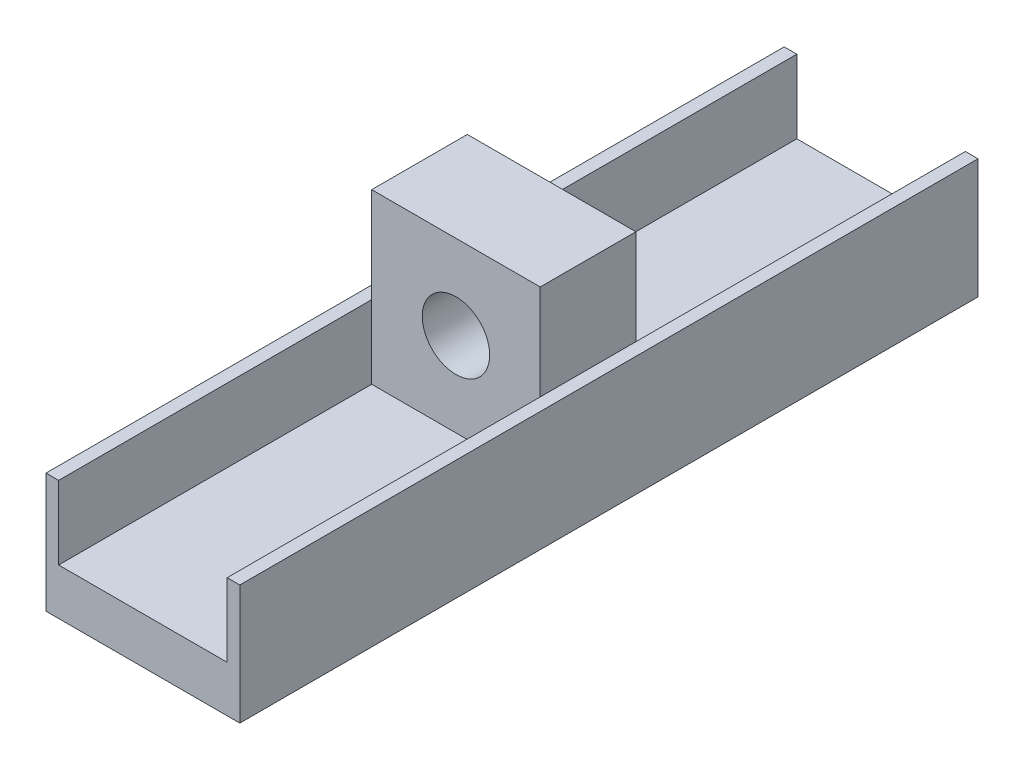
ISO-10303-21;
HEADER;
FILE_DESCRIPTION(('STEP AP214'),'2;1');
FILE_NAME('part.step','',(''),(''),'','','');
FILE_SCHEMA(('AUTOMOTIVE_DESIGN { 1 0 10303 214 1 1 1 1 }'));
ENDSEC;
DATA;
#1=APPLICATION_CONTEXT('core data for automotive mechanical design processes');
#2=APPLICATION_PROTOCOL_DEFINITION('international standard','automotive_design',2000,#1);
#3=PRODUCT_CONTEXT('',#1,'mechanical');
#4=PRODUCT('Part','Part','',(#3));
#5=PRODUCT_RELATED_PRODUCT_CATEGORY('part','',(#4));
#6=PRODUCT_DEFINITION_FORMATION('','',#4);
#7=PRODUCT_DEFINITION_CONTEXT('part definition',#1,'design');
#8=PRODUCT_DEFINITION('design','',#6,#7);
#9=PRODUCT_DEFINITION_SHAPE('','',#8);
#10=(LENGTH_UNIT() NAMED_UNIT(*) SI_UNIT(.MILLI.,.METRE.));
#11=(NAMED_UNIT(*) PLANE_ANGLE_UNIT() SI_UNIT($,.RADIAN.));
#12=(NAMED_UNIT(*) SI_UNIT($,.STERADIAN.) SOLID_ANGLE_UNIT());
#13=UNCERTAINTY_MEASURE_WITH_UNIT(LENGTH_MEASURE(1.E-05),#10,'distance_accuracy_value','');
#14=(GEOMETRIC_REPRESENTATION_CONTEXT(3) GLOBAL_UNCERTAINTY_ASSIGNED_CONTEXT((#13)) GLOBAL_UNIT_ASSIGNED_CONTEXT((#10,
#11,#12)) REPRESENTATION_CONTEXT('',''));
#15=CARTESIAN_POINT('',(0.,0.,0.));
#16=DIRECTION('',(0.,0.,1.));
#17=DIRECTION('',(1.,0.,0.));
#18=AXIS2_PLACEMENT_3D('',#15,#16,#17);
#19=CARTESIAN_POINT('',(1.1,2.60289581411237,13.4));
#20=DIRECTION('',(0.,0.,1.));
#21=DIRECTION('',(1.,0.,0.));
#22=AXIS2_PLACEMENT_3D('',#19,#20,#21);
#23=CYLINDRICAL_SURFACE('',#22,8.);
#24=CARTESIAN_POINT('',(1.1,2.60289581411237,11.1));
#25=DIRECTION('',(0.,0.,1.));
#26=DIRECTION('',(1.,0.,0.));
#27=AXIS2_PLACEMENT_3D('',#24,#25,#26);
#28=CIRCLE('',#27,8.);
#29=CARTESIAN_POINT('',(9.1,2.60289581411237,11.1));
#30=VERTEX_POINT('',#29);
#31=EDGE_CURVE('E162',#30,#30,#28,.F.);
#32=ORIENTED_EDGE('',*,*,#31,.F.);
#33=EDGE_LOOP('',(#32));
#34=FACE_BOUND('',#33,.T.);
#35=CARTESIAN_POINT('',(1.1,2.60289581411237,-11.6));
#36=DIRECTION('',(0.,0.,1.));
#37=DIRECTION('',(1.,0.,0.));
#38=AXIS2_PLACEMENT_3D('',#35,#36,#37);
#39=CIRCLE('',#38,8.);
#40=CARTESIAN_POINT('',(9.1,2.60289581411237,-11.6));
#41=VERTEX_POINT('',#40);
#42=EDGE_CURVE('E20',#41,#41,#39,.F.);
#43=ORIENTED_EDGE('',*,*,#42,.T.);
#44=EDGE_LOOP('',(#43));
#45=FACE_BOUND('',#44,.T.);
#46=ADVANCED_FACE('F17',(#34,#45),#23,.F.);
#47=CARTESIAN_POINT('',(-18.9,22.6028958141124,13.4));
#48=DIRECTION('',(0.,-1.,0.));
#49=DIRECTION('',(0.,0.,-1.));
#50=AXIS2_PLACEMENT_3D('',#47,#48,#49);
#51=PLANE('',#50);
#52=DIRECTION('',(1.,0.,0.));
#53=VECTOR('',#52,1.);
#54=CARTESIAN_POINT('',(-12.1850327602071,22.6028958141124,-11.6));
#55=LINE('',#54,#53);
#56=CARTESIAN_POINT('',(21.1,22.6028958141124,-11.6));
#57=VERTEX_POINT('',#56);
#58=CARTESIAN_POINT('',(-18.9,22.6028958141124,-11.6));
#59=VERTEX_POINT('',#58);
#60=EDGE_CURVE('E142',#57,#59,#55,.F.);
#61=ORIENTED_EDGE('',*,*,#60,.T.);
#62=DIRECTION('',(0.,0.,-1.));
#63=VECTOR('',#62,1.);
#64=CARTESIAN_POINT('',(-18.9,22.6028958141124,13.4));
#65=LINE('',#64,#63);
#66=CARTESIAN_POINT('',(-18.9,22.6028958141124,11.1));
#67=VERTEX_POINT('',#66);
#68=EDGE_CURVE('E145',#59,#67,#65,.F.);
#69=ORIENTED_EDGE('',*,*,#68,.T.);
#70=DIRECTION('',(1.,0.,0.));
#71=VECTOR('',#70,1.);
#72=CARTESIAN_POINT('',(-12.1850327602071,22.6028958141124,11.1));
#73=LINE('',#72,#71);
#74=CARTESIAN_POINT('',(21.1,22.6028958141124,11.1));
#75=VERTEX_POINT('',#74);
#76=EDGE_CURVE('E137',#75,#67,#73,.F.);
#77=ORIENTED_EDGE('',*,*,#76,.F.);
#78=DIRECTION('',(0.,0.,1.));
#79=VECTOR('',#78,1.);
#80=CARTESIAN_POINT('',(21.1,22.6028958141124,13.4));
#81=LINE('',#80,#79);
#82=EDGE_CURVE('E148',#75,#57,#81,.F.);
#83=ORIENTED_EDGE('',*,*,#82,.T.);
#84=EDGE_LOOP('',(#61,#69,#77,#83));
#85=FACE_BOUND('',#84,.T.);
#86=ADVANCED_FACE('F144',(#85),#51,.F.);
#87=CARTESIAN_POINT('',(-12.1850327602071,-25.6006360607454,-11.6));
#88=DIRECTION('',(0.,0.,1.));
#89=DIRECTION('',(1.,0.,0.));
#90=AXIS2_PLACEMENT_3D('',#87,#88,#89);
#91=PLANE('',#90);
#92=DIRECTION('',(1.,0.,0.));
#93=VECTOR('',#92,1.);
#94=CARTESIAN_POINT('',(21.1,-17.3971041858876,-11.6));
#95=LINE('',#94,#93);
#96=CARTESIAN_POINT('',(21.1,-17.3971041858876,-11.6));
#97=VERTEX_POINT('',#96);
#98=CARTESIAN_POINT('',(-18.9,-17.3971041858876,-11.6));
#99=VERTEX_POINT('',#98);
#100=EDGE_CURVE('E198',#97,#99,#95,.F.);
#101=ORIENTED_EDGE('',*,*,#100,.T.);
#102=DIRECTION('',(0.,1.,0.));
#103=VECTOR('',#102,1.);
#104=CARTESIAN_POINT('',(-18.9,-17.3971041858876,-11.6));
#105=LINE('',#104,#103);
#106=CARTESIAN_POINT('',(-18.9,0.,-11.6));
#107=VERTEX_POINT('',#106);
#108=EDGE_CURVE('E167',#99,#107,#105,.T.);
#109=ORIENTED_EDGE('',*,*,#108,.T.);
#110=DIRECTION('',(0.,1.,0.));
#111=VECTOR('',#110,1.);
#112=CARTESIAN_POINT('',(-18.9,-17.3971041858876,-11.6));
#113=LINE('',#112,#111);
#114=EDGE_CURVE('E154',#107,#59,#113,.T.);
#115=ORIENTED_EDGE('',*,*,#114,.T.);
#116=ORIENTED_EDGE('',*,*,#60,.F.);
#117=DIRECTION('',(0.,1.,0.));
#118=VECTOR('',#117,1.);
#119=CARTESIAN_POINT('',(21.1,22.6028958141124,-11.6));
#120=LINE('',#119,#118);
#121=CARTESIAN_POINT('',(21.1,0.,-11.6));
#122=VERTEX_POINT('',#121);
#123=EDGE_CURVE('E190',#57,#122,#120,.F.);
#124=ORIENTED_EDGE('',*,*,#123,.T.);
#125=DIRECTION('',(0.,1.,0.));
#126=VECTOR('',#125,1.);
#127=CARTESIAN_POINT('',(21.1,0.,-11.6));
#128=LINE('',#127,#126);
#129=EDGE_CURVE('E201',#122,#97,#128,.F.);
#130=ORIENTED_EDGE('',*,*,#129,.T.);
#131=EDGE_LOOP('',(#101,#109,#115,#116,#124,#130));
#132=FACE_BOUND('',#131,.T.);
#133=ORIENTED_EDGE('',*,*,#42,.F.);
#134=EDGE_LOOP('',(#133));
#135=FACE_BOUND('',#134,.T.);
#136=ADVANCED_FACE('F165',(#132,#135),#91,.F.);
#137=CARTESIAN_POINT('',(-18.9,-17.3971041858876,13.4));
#138=DIRECTION('',(1.,0.,0.));
#139=DIRECTION('',(0.,0.,-1.));
#140=AXIS2_PLACEMENT_3D('',#137,#138,#139);
#141=PLANE('',#140);
#142=DIRECTION('',(0.,1.,0.));
#143=VECTOR('',#142,1.);
#144=CARTESIAN_POINT('',(-18.9,-25.6006360607454,11.1));
#145=LINE('',#144,#143);
#146=CARTESIAN_POINT('',(-18.9,0.,11.1));
#147=VERTEX_POINT('',#146);
#148=EDGE_CURVE('E160',#67,#147,#145,.F.);
#149=ORIENTED_EDGE('',*,*,#148,.F.);
#150=ORIENTED_EDGE('',*,*,#68,.F.);
#151=ORIENTED_EDGE('',*,*,#114,.F.);
#152=DIRECTION('',(0.,0.,-1.));
#153=VECTOR('',#152,1.);
#154=CARTESIAN_POINT('',(-18.9,0.,-40.));
#155=LINE('',#154,#153);
#156=EDGE_CURVE('E212',#107,#147,#155,.F.);
#157=ORIENTED_EDGE('',*,*,#156,.T.);
#158=EDGE_LOOP('',(#149,#150,#151,#157));
#159=FACE_BOUND('',#158,.T.);
#160=ADVANCED_FACE('F157',(#159),#141,.F.);
#161=CARTESIAN_POINT('',(-12.1850327602071,-25.6006360607454,11.1));
#162=DIRECTION('',(0.,0.,1.));
#163=DIRECTION('',(1.,0.,0.));
#164=AXIS2_PLACEMENT_3D('',#161,#162,#163);
#165=PLANE('',#164);
#166=DIRECTION('',(1.,0.,0.));
#167=VECTOR('',#166,1.);
#168=CARTESIAN_POINT('',(21.1,-17.3971041858876,11.1));
#169=LINE('',#168,#167);
#170=CARTESIAN_POINT('',(-18.9,-17.3971041858876,11.1));
#171=VERTEX_POINT('',#170);
#172=CARTESIAN_POINT('',(21.1,-17.3971041858876,11.1));
#173=VERTEX_POINT('',#172);
#174=EDGE_CURVE('E222',#171,#173,#169,.T.);
#175=ORIENTED_EDGE('',*,*,#174,.T.);
#176=DIRECTION('',(0.,1.,0.));
#177=VECTOR('',#176,1.);
#178=CARTESIAN_POINT('',(21.1,0.,11.1));
#179=LINE('',#178,#177);
#180=CARTESIAN_POINT('',(21.1,0.,11.1));
#181=VERTEX_POINT('',#180);
#182=EDGE_CURVE('E232',#173,#181,#179,.T.);
#183=ORIENTED_EDGE('',*,*,#182,.T.);
#184=DIRECTION('',(0.,1.,0.));
#185=VECTOR('',#184,1.);
#186=CARTESIAN_POINT('',(21.1,22.6028958141124,11.1));
#187=LINE('',#186,#185);
#188=EDGE_CURVE('E183',#181,#75,#187,.T.);
#189=ORIENTED_EDGE('',*,*,#188,.T.);
#190=ORIENTED_EDGE('',*,*,#76,.T.);
#191=ORIENTED_EDGE('',*,*,#148,.T.);
#192=DIRECTION('',(0.,1.,0.));
#193=VECTOR('',#192,1.);
#194=CARTESIAN_POINT('',(-18.9,-17.3971041858876,11.1));
#195=LINE('',#194,#193);
#196=EDGE_CURVE('E214',#147,#171,#195,.F.);
#197=ORIENTED_EDGE('',*,*,#196,.T.);
#198=EDGE_LOOP('',(#175,#183,#189,#190,#191,#197));
#199=FACE_BOUND('',#198,.T.);
#200=ORIENTED_EDGE('',*,*,#31,.T.);
#201=EDGE_LOOP('',(#200));
#202=FACE_BOUND('',#201,.T.);
#203=ADVANCED_FACE('F380',(#199,#202),#165,.T.);
#204=CARTESIAN_POINT('',(21.1,22.6028958141124,13.4));
#205=DIRECTION('',(-1.,0.,0.));
#206=DIRECTION('',(0.,0.,1.));
#207=AXIS2_PLACEMENT_3D('',#204,#205,#206);
#208=PLANE('',#207);
#209=ORIENTED_EDGE('',*,*,#123,.F.);
#210=ORIENTED_EDGE('',*,*,#82,.F.);
#211=ORIENTED_EDGE('',*,*,#188,.F.);
#212=DIRECTION('',(0.,0.,-1.));
#213=VECTOR('',#212,1.);
#214=CARTESIAN_POINT('',(21.1,0.,-40.));
#215=LINE('',#214,#213);
#216=EDGE_CURVE('E240',#181,#122,#215,.T.);
#217=ORIENTED_EDGE('',*,*,#216,.T.);
#218=EDGE_LOOP('',(#209,#210,#211,#217));
#219=FACE_BOUND('',#218,.T.);
#220=ADVANCED_FACE('F376',(#219),#208,.F.);
#221=CARTESIAN_POINT('',(-18.9,-17.3971041858876,-40.));
#222=DIRECTION('',(-1.,0.,0.));
#223=DIRECTION('',(0.,0.,1.));
#224=AXIS2_PLACEMENT_3D('',#221,#222,#223);
#225=PLANE('',#224);
#226=ORIENTED_EDGE('',*,*,#108,.F.);
#227=DIRECTION('',(0.,0.,-1.));
#228=VECTOR('',#227,1.);
#229=CARTESIAN_POINT('',(-18.9,-17.3971041858876,-40.));
#230=LINE('',#229,#228);
#231=CARTESIAN_POINT('',(-18.9,-17.3971041858876,-89.8));
#232=VERTEX_POINT('',#231);
#233=EDGE_CURVE('E195',#99,#232,#230,.T.);
#234=ORIENTED_EDGE('',*,*,#233,.T.);
#235=DIRECTION('',(0.,1.,0.));
#236=VECTOR('',#235,1.);
#237=CARTESIAN_POINT('',(-18.9,4.24242343595816,-89.8));
#238=LINE('',#237,#236);
#239=CARTESIAN_POINT('',(-18.9,0.,-89.8));
#240=VERTEX_POINT('',#239);
#241=EDGE_CURVE('E252',#240,#232,#238,.F.);
#242=ORIENTED_EDGE('',*,*,#241,.F.);
#243=DIRECTION('',(0.,0.,-1.));
#244=VECTOR('',#243,1.);
#245=CARTESIAN_POINT('',(-18.9,0.,-40.));
#246=LINE('',#245,#244);
#247=EDGE_CURVE('E209',#240,#107,#246,.F.);
#248=ORIENTED_EDGE('',*,*,#247,.T.);
#249=EDGE_LOOP('',(#226,#234,#242,#248));
#250=FACE_BOUND('',#249,.T.);
#251=ADVANCED_FACE('F372',(#250),#225,.F.);
#252=CARTESIAN_POINT('',(21.1,-17.3971041858876,-40.));
#253=DIRECTION('',(0.,-1.,0.));
#254=DIRECTION('',(0.,0.,-1.));
#255=AXIS2_PLACEMENT_3D('',#252,#253,#254);
#256=PLANE('',#255);
#257=DIRECTION('',(0.,0.,-1.));
#258=VECTOR('',#257,1.);
#259=CARTESIAN_POINT('',(21.1,-17.3971041858876,-40.));
#260=LINE('',#259,#258);
#261=CARTESIAN_POINT('',(21.1,-17.3971041858876,-89.8));
#262=VERTEX_POINT('',#261);
#263=EDGE_CURVE('E205',#97,#262,#260,.T.);
#264=ORIENTED_EDGE('',*,*,#263,.T.);
#265=DIRECTION('',(-1.,0.,0.));
#266=VECTOR('',#265,1.);
#267=CARTESIAN_POINT('',(23.9096558256762,-17.3971041858876,-89.8));
#268=LINE('',#267,#266);
#269=EDGE_CURVE('E255',#232,#262,#268,.F.);
#270=ORIENTED_EDGE('',*,*,#269,.F.);
#271=ORIENTED_EDGE('',*,*,#233,.F.);
#272=ORIENTED_EDGE('',*,*,#100,.F.);
#273=EDGE_LOOP('',(#264,#270,#271,#272));
#274=FACE_BOUND('',#273,.T.);
#275=ADVANCED_FACE('F368',(#274),#256,.F.);
#276=CARTESIAN_POINT('',(21.1,0.,-40.));
#277=DIRECTION('',(1.,0.,0.));
#278=DIRECTION('',(0.,0.,-1.));
#279=AXIS2_PLACEMENT_3D('',#276,#277,#278);
#280=PLANE('',#279);
#281=DIRECTION('',(0.,1.,0.));
#282=VECTOR('',#281,1.);
#283=CARTESIAN_POINT('',(21.1,4.24242343595816,-89.8));
#284=LINE('',#283,#282);
#285=CARTESIAN_POINT('',(21.1,0.,-89.8));
#286=VERTEX_POINT('',#285);
#287=EDGE_CURVE('E258',#262,#286,#284,.T.);
#288=ORIENTED_EDGE('',*,*,#287,.F.);
#289=ORIENTED_EDGE('',*,*,#263,.F.);
#290=ORIENTED_EDGE('',*,*,#129,.F.);
#291=DIRECTION('',(0.,0.,-1.));
#292=VECTOR('',#291,1.);
#293=CARTESIAN_POINT('',(21.1,0.,-40.));
#294=LINE('',#293,#292);
#295=EDGE_CURVE('E244',#122,#286,#294,.T.);
#296=ORIENTED_EDGE('',*,*,#295,.T.);
#297=EDGE_LOOP('',(#288,#289,#290,#296));
#298=FACE_BOUND('',#297,.T.);
#299=ADVANCED_FACE('F364',(#298),#280,.F.);
#300=CARTESIAN_POINT('',(-18.9,0.,-40.));
#301=DIRECTION('',(0.,-1.,0.));
#302=DIRECTION('',(0.,0.,-1.));
#303=AXIS2_PLACEMENT_3D('',#300,#301,#302);
#304=PLANE('',#303);
#305=ORIENTED_EDGE('',*,*,#247,.F.);
#306=DIRECTION('',(-1.,0.,0.));
#307=VECTOR('',#306,1.);
#308=CARTESIAN_POINT('',(23.9096558256762,0.,-89.8));
#309=LINE('',#308,#307);
#310=CARTESIAN_POINT('',(-21.9,0.,-89.8));
#311=VERTEX_POINT('',#310);
#312=EDGE_CURVE('E248',#311,#240,#309,.F.);
#313=ORIENTED_EDGE('',*,*,#312,.F.);
#314=DIRECTION('',(0.,0.,-1.));
#315=VECTOR('',#314,1.);
#316=CARTESIAN_POINT('',(-21.9,0.,-40.));
#317=LINE('',#316,#315);
#318=CARTESIAN_POINT('',(-21.9,0.,85.4));
#319=VERTEX_POINT('',#318);
#320=EDGE_CURVE('E268',#311,#319,#317,.F.);
#321=ORIENTED_EDGE('',*,*,#320,.T.);
#322=DIRECTION('',(-1.,0.,0.));
#323=VECTOR('',#322,1.);
#324=CARTESIAN_POINT('',(23.9096558256762,0.,85.4));
#325=LINE('',#324,#323);
#326=CARTESIAN_POINT('',(-18.9,0.,85.4));
#327=VERTEX_POINT('',#326);
#328=EDGE_CURVE('E275',#319,#327,#325,.F.);
#329=ORIENTED_EDGE('',*,*,#328,.T.);
#330=DIRECTION('',(0.,0.,1.));
#331=VECTOR('',#330,1.);
#332=CARTESIAN_POINT('',(-18.9,0.,-40.));
#333=LINE('',#332,#331);
#334=EDGE_CURVE('E218',#327,#147,#333,.F.);
#335=ORIENTED_EDGE('',*,*,#334,.T.);
#336=ORIENTED_EDGE('',*,*,#156,.F.);
#337=EDGE_LOOP('',(#305,#313,#321,#329,#335,#336));
#338=FACE_BOUND('',#337,.T.);
#339=ADVANCED_FACE('F360',(#338),#304,.F.);
#340=CARTESIAN_POINT('',(-18.9,-17.3971041858876,-40.));
#341=DIRECTION('',(-1.,0.,0.));
#342=DIRECTION('',(0.,0.,1.));
#343=AXIS2_PLACEMENT_3D('',#340,#341,#342);
#344=PLANE('',#343);
#345=DIRECTION('',(0.,1.,0.));
#346=VECTOR('',#345,1.);
#347=CARTESIAN_POINT('',(-18.9,4.24242343595816,85.4));
#348=LINE('',#347,#346);
#349=CARTESIAN_POINT('',(-18.9,-17.3971041858876,85.4));
#350=VERTEX_POINT('',#349);
#351=EDGE_CURVE('E279',#327,#350,#348,.F.);
#352=ORIENTED_EDGE('',*,*,#351,.T.);
#353=DIRECTION('',(0.,0.,-1.));
#354=VECTOR('',#353,1.);
#355=CARTESIAN_POINT('',(-18.9,-17.3971041858876,-40.));
#356=LINE('',#355,#354);
#357=EDGE_CURVE('E224',#350,#171,#356,.T.);
#358=ORIENTED_EDGE('',*,*,#357,.T.);
#359=ORIENTED_EDGE('',*,*,#196,.F.);
#360=ORIENTED_EDGE('',*,*,#334,.F.);
#361=EDGE_LOOP('',(#352,#358,#359,#360));
#362=FACE_BOUND('',#361,.T.);
#363=ADVANCED_FACE('F356',(#362),#344,.F.);
#364=CARTESIAN_POINT('',(21.1,-17.3971041858876,-40.));
#365=DIRECTION('',(0.,-1.,0.));
#366=DIRECTION('',(0.,0.,-1.));
#367=AXIS2_PLACEMENT_3D('',#364,#365,#366);
#368=PLANE('',#367);
#369=DIRECTION('',(-1.,0.,0.));
#370=VECTOR('',#369,1.);
#371=CARTESIAN_POINT('',(23.9096558256762,-17.3971041858876,85.4));
#372=LINE('',#371,#370);
#373=CARTESIAN_POINT('',(21.1,-17.3971041858876,85.4));
#374=VERTEX_POINT('',#373);
#375=EDGE_CURVE('E283',#350,#374,#372,.F.);
#376=ORIENTED_EDGE('',*,*,#375,.T.);
#377=DIRECTION('',(0.,0.,-1.));
#378=VECTOR('',#377,1.);
#379=CARTESIAN_POINT('',(21.1,-17.3971041858876,-40.));
#380=LINE('',#379,#378);
#381=EDGE_CURVE('E228',#374,#173,#380,.T.);
#382=ORIENTED_EDGE('',*,*,#381,.T.);
#383=ORIENTED_EDGE('',*,*,#174,.F.);
#384=ORIENTED_EDGE('',*,*,#357,.F.);
#385=EDGE_LOOP('',(#376,#382,#383,#384));
#386=FACE_BOUND('',#385,.T.);
#387=ADVANCED_FACE('F352',(#386),#368,.F.);
#388=CARTESIAN_POINT('',(21.1,0.,-40.));
#389=DIRECTION('',(1.,0.,0.));
#390=DIRECTION('',(0.,0.,-1.));
#391=AXIS2_PLACEMENT_3D('',#388,#389,#390);
#392=PLANE('',#391);
#393=ORIENTED_EDGE('',*,*,#182,.F.);
#394=ORIENTED_EDGE('',*,*,#381,.F.);
#395=DIRECTION('',(0.,1.,0.));
#396=VECTOR('',#395,1.);
#397=CARTESIAN_POINT('',(21.1,4.24242343595816,85.4));
#398=LINE('',#397,#396);
#399=CARTESIAN_POINT('',(21.1,0.,85.4));
#400=VERTEX_POINT('',#399);
#401=EDGE_CURVE('E287',#374,#400,#398,.T.);
#402=ORIENTED_EDGE('',*,*,#401,.T.);
#403=DIRECTION('',(0.,0.,-1.));
#404=VECTOR('',#403,1.);
#405=CARTESIAN_POINT('',(21.1,0.,-40.));
#406=LINE('',#405,#404);
#407=EDGE_CURVE('E236',#400,#181,#406,.T.);
#408=ORIENTED_EDGE('',*,*,#407,.T.);
#409=EDGE_LOOP('',(#393,#394,#402,#408));
#410=FACE_BOUND('',#409,.T.);
#411=ADVANCED_FACE('F348',(#410),#392,.F.);
#412=CARTESIAN_POINT('',(24.1,0.,-40.));
#413=DIRECTION('',(0.,-1.,0.));
#414=DIRECTION('',(0.,0.,-1.));
#415=AXIS2_PLACEMENT_3D('',#412,#413,#414);
#416=PLANE('',#415);
#417=ORIENTED_EDGE('',*,*,#216,.F.);
#418=ORIENTED_EDGE('',*,*,#407,.F.);
#419=DIRECTION('',(-1.,0.,0.));
#420=VECTOR('',#419,1.);
#421=CARTESIAN_POINT('',(23.9096558256762,0.,85.4));
#422=LINE('',#421,#420);
#423=CARTESIAN_POINT('',(24.1,0.,85.4));
#424=VERTEX_POINT('',#423);
#425=EDGE_CURVE('E291',#400,#424,#422,.F.);
#426=ORIENTED_EDGE('',*,*,#425,.T.);
#427=DIRECTION('',(0.,0.,1.));
#428=VECTOR('',#427,1.);
#429=CARTESIAN_POINT('',(24.1,0.,-40.));
#430=LINE('',#429,#428);
#431=CARTESIAN_POINT('',(24.1,0.,-89.8));
#432=VERTEX_POINT('',#431);
#433=EDGE_CURVE('E300',#424,#432,#430,.F.);
#434=ORIENTED_EDGE('',*,*,#433,.T.);
#435=DIRECTION('',(-1.,0.,0.));
#436=VECTOR('',#435,1.);
#437=CARTESIAN_POINT('',(23.9096558256762,0.,-89.8));
#438=LINE('',#437,#436);
#439=EDGE_CURVE('E261',#286,#432,#438,.F.);
#440=ORIENTED_EDGE('',*,*,#439,.F.);
#441=ORIENTED_EDGE('',*,*,#295,.F.);
#442=EDGE_LOOP('',(#417,#418,#426,#434,#440,#441));
#443=FACE_BOUND('',#442,.T.);
#444=ADVANCED_FACE('F345',(#443),#416,.F.);
#445=CARTESIAN_POINT('',(23.9096558256762,4.24242343595816,-89.8));
#446=DIRECTION('',(0.,0.,-1.));
#447=DIRECTION('',(-1.,0.,0.));
#448=AXIS2_PLACEMENT_3D('',#445,#446,#447);
#449=PLANE('',#448);
#450=ORIENTED_EDGE('',*,*,#439,.T.);
#451=DIRECTION('',(0.,1.,0.));
#452=VECTOR('',#451,1.);
#453=CARTESIAN_POINT('',(24.1,-28.3971041858876,-89.8));
#454=LINE('',#453,#452);
#455=CARTESIAN_POINT('',(24.1,-28.3971041858876,-89.8));
#456=VERTEX_POINT('',#455);
#457=EDGE_CURVE('E294',#432,#456,#454,.F.);
#458=ORIENTED_EDGE('',*,*,#457,.T.);
#459=DIRECTION('',(1.,0.,0.));
#460=VECTOR('',#459,1.);
#461=CARTESIAN_POINT('',(-21.9,-28.3971041858876,-89.8));
#462=LINE('',#461,#460);
#463=CARTESIAN_POINT('',(-21.9,-28.3971041858876,-89.8));
#464=VERTEX_POINT('',#463);
#465=EDGE_CURVE('E304',#456,#464,#462,.F.);
#466=ORIENTED_EDGE('',*,*,#465,.T.);
#467=DIRECTION('',(0.,1.,0.));
#468=VECTOR('',#467,1.);
#469=CARTESIAN_POINT('',(-21.9,0.,-89.8));
#470=LINE('',#469,#468);
#471=EDGE_CURVE('E264',#464,#311,#470,.T.);
#472=ORIENTED_EDGE('',*,*,#471,.T.);
#473=ORIENTED_EDGE('',*,*,#312,.T.);
#474=ORIENTED_EDGE('',*,*,#241,.T.);
#475=ORIENTED_EDGE('',*,*,#269,.T.);
#476=ORIENTED_EDGE('',*,*,#287,.T.);
#477=EDGE_LOOP('',(#450,#458,#466,#472,#473,#474,#475,#476));
#478=FACE_BOUND('',#477,.T.);
#479=ADVANCED_FACE('F326',(#478),#449,.T.);
#480=CARTESIAN_POINT('',(-21.9,0.,-40.));
#481=DIRECTION('',(1.,0.,0.));
#482=DIRECTION('',(0.,0.,-1.));
#483=AXIS2_PLACEMENT_3D('',#480,#481,#482);
#484=PLANE('',#483);
#485=DIRECTION('',(0.,1.,0.));
#486=VECTOR('',#485,1.);
#487=CARTESIAN_POINT('',(-21.9,4.24242343595816,85.4));
#488=LINE('',#487,#486);
#489=CARTESIAN_POINT('',(-21.9,-28.3971041858876,85.4));
#490=VERTEX_POINT('',#489);
#491=EDGE_CURVE('E271',#490,#319,#488,.T.);
#492=ORIENTED_EDGE('',*,*,#491,.T.);
#493=ORIENTED_EDGE('',*,*,#320,.F.);
#494=ORIENTED_EDGE('',*,*,#471,.F.);
#495=DIRECTION('',(0.,0.,1.));
#496=VECTOR('',#495,1.);
#497=CARTESIAN_POINT('',(-21.9,-28.3971041858876,-40.));
#498=LINE('',#497,#496);
#499=EDGE_CURVE('E308',#464,#490,#498,.T.);
#500=ORIENTED_EDGE('',*,*,#499,.T.);
#501=EDGE_LOOP('',(#492,#493,#494,#500));
#502=FACE_BOUND('',#501,.T.);
#503=ADVANCED_FACE('F323',(#502),#484,.F.);
#504=CARTESIAN_POINT('',(23.9096558256762,4.24242343595816,85.4));
#505=DIRECTION('',(0.,0.,-1.));
#506=DIRECTION('',(-1.,0.,0.));
#507=AXIS2_PLACEMENT_3D('',#504,#505,#506);
#508=PLANE('',#507);
#509=ORIENTED_EDGE('',*,*,#425,.F.);
#510=ORIENTED_EDGE('',*,*,#401,.F.);
#511=ORIENTED_EDGE('',*,*,#375,.F.);
#512=ORIENTED_EDGE('',*,*,#351,.F.);
#513=ORIENTED_EDGE('',*,*,#328,.F.);
#514=ORIENTED_EDGE('',*,*,#491,.F.);
#515=DIRECTION('',(1.,0.,0.));
#516=VECTOR('',#515,1.);
#517=CARTESIAN_POINT('',(-21.9,-28.3971041858876,85.4));
#518=LINE('',#517,#516);
#519=CARTESIAN_POINT('',(24.1,-28.3971041858876,85.4));
#520=VERTEX_POINT('',#519);
#521=EDGE_CURVE('E27',#490,#520,#518,.T.);
#522=ORIENTED_EDGE('',*,*,#521,.T.);
#523=DIRECTION('',(0.,1.,0.));
#524=VECTOR('',#523,1.);
#525=CARTESIAN_POINT('',(24.1,-28.3971041858876,85.4));
#526=LINE('',#525,#524);
#527=EDGE_CURVE('E35',#520,#424,#526,.T.);
#528=ORIENTED_EDGE('',*,*,#527,.T.);
#529=EDGE_LOOP('',(#509,#510,#511,#512,#513,#514,#522,#528));
#530=FACE_BOUND('',#529,.T.);
#531=ADVANCED_FACE('F317',(#530),#508,.F.);
#532=CARTESIAN_POINT('',(24.1,-28.3971041858876,-40.));
#533=DIRECTION('',(-1.,0.,0.));
#534=DIRECTION('',(0.,0.,1.));
#535=AXIS2_PLACEMENT_3D('',#532,#533,#534);
#536=PLANE('',#535);
#537=ORIENTED_EDGE('',*,*,#527,.F.);
#538=DIRECTION('',(0.,0.,1.));
#539=VECTOR('',#538,1.);
#540=CARTESIAN_POINT('',(24.1,-28.3971041858876,-40.));
#541=LINE('',#540,#539);
#542=EDGE_CURVE('E11',#520,#456,#541,.F.);
#543=ORIENTED_EDGE('',*,*,#542,.T.);
#544=ORIENTED_EDGE('',*,*,#457,.F.);
#545=ORIENTED_EDGE('',*,*,#433,.F.);
#546=EDGE_LOOP('',(#537,#543,#544,#545));
#547=FACE_BOUND('',#546,.T.);
#548=ADVANCED_FACE('F330',(#547),#536,.F.);
#549=CARTESIAN_POINT('',(-21.9,-28.3971041858876,-40.));
#550=DIRECTION('',(0.,1.,0.));
#551=DIRECTION('',(0.,0.,1.));
#552=AXIS2_PLACEMENT_3D('',#549,#550,#551);
#553=PLANE('',#552);
#554=ORIENTED_EDGE('',*,*,#521,.F.);
#555=ORIENTED_EDGE('',*,*,#499,.F.);
#556=ORIENTED_EDGE('',*,*,#465,.F.);
#557=ORIENTED_EDGE('',*,*,#542,.F.);
#558=EDGE_LOOP('',(#554,#555,#556,#557));
#559=FACE_BOUND('',#558,.T.);
#560=ADVANCED_FACE('F321',(#559),#553,.F.);
#561=CLOSED_SHELL('',(#46,#86,#136,#160,#203,#220,#251,#275,#299,#339,#363,#387,#411,#444,#479,
#503,#531,#548,#560));
#562=MANIFOLD_SOLID_BREP('B1',#561);
#563=ADVANCED_BREP_SHAPE_REPRESENTATION('',(#18,#562),#14);
#564=SHAPE_DEFINITION_REPRESENTATION(#9,#563);
ENDSEC;
END-ISO-10303-21;
